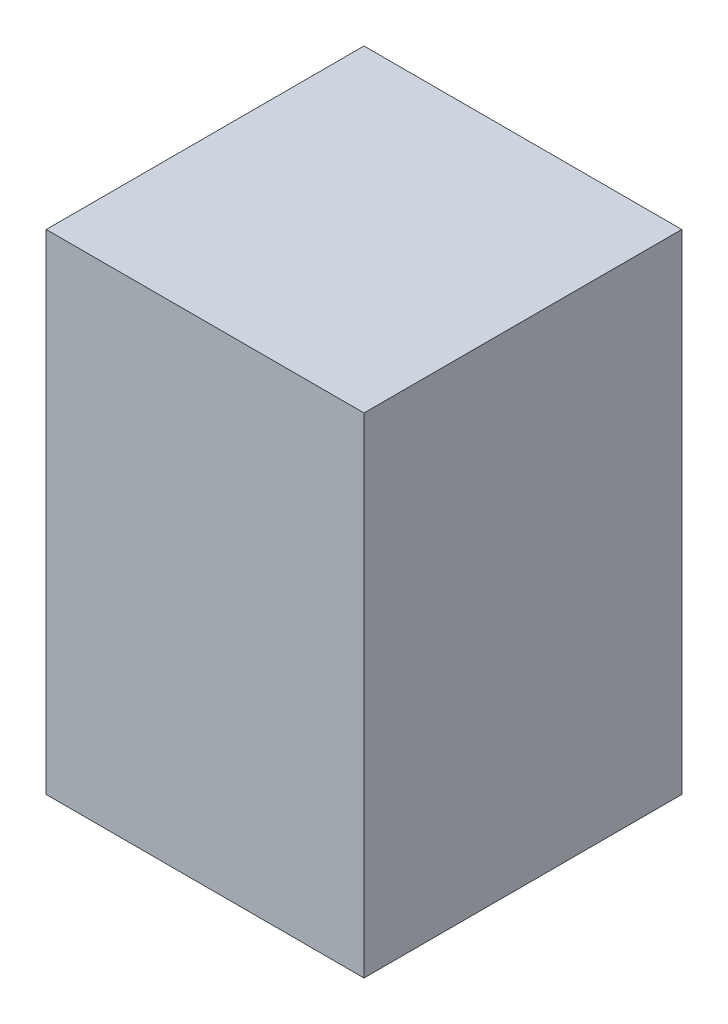
ISO-10303-21;
HEADER;
FILE_DESCRIPTION(('STEP AP214'),'2;1');
FILE_NAME('part.step','',(''),(''),'','','');
FILE_SCHEMA(('AUTOMOTIVE_DESIGN { 1 0 10303 214 1 1 1 1 }'));
ENDSEC;
DATA;
#1=APPLICATION_CONTEXT('core data for automotive mechanical design processes');
#2=APPLICATION_PROTOCOL_DEFINITION('international standard','automotive_design',2000,#1);
#3=PRODUCT_CONTEXT('',#1,'mechanical');
#4=PRODUCT('Part','Part','',(#3));
#5=PRODUCT_RELATED_PRODUCT_CATEGORY('part','',(#4));
#6=PRODUCT_DEFINITION_FORMATION('','',#4);
#7=PRODUCT_DEFINITION_CONTEXT('part definition',#1,'design');
#8=PRODUCT_DEFINITION('design','',#6,#7);
#9=PRODUCT_DEFINITION_SHAPE('','',#8);
#10=(LENGTH_UNIT() NAMED_UNIT(*) SI_UNIT(.MILLI.,.METRE.));
#11=(NAMED_UNIT(*) PLANE_ANGLE_UNIT() SI_UNIT($,.RADIAN.));
#12=(NAMED_UNIT(*) SI_UNIT($,.STERADIAN.) SOLID_ANGLE_UNIT());
#13=UNCERTAINTY_MEASURE_WITH_UNIT(LENGTH_MEASURE(1.E-05),#10,'distance_accuracy_value','');
#14=(GEOMETRIC_REPRESENTATION_CONTEXT(3) GLOBAL_UNCERTAINTY_ASSIGNED_CONTEXT((#13)) GLOBAL_UNIT_ASSIGNED_CONTEXT((#10,
#11,#12)) REPRESENTATION_CONTEXT('',''));
#15=CARTESIAN_POINT('',(0.,0.,0.));
#16=DIRECTION('',(0.,0.,1.));
#17=DIRECTION('',(1.,0.,0.));
#18=AXIS2_PLACEMENT_3D('',#15,#16,#17);
#19=CARTESIAN_POINT('',(250.,770.,250.));
#20=DIRECTION('',(-1.,0.,0.));
#21=DIRECTION('',(0.,0.,1.));
#22=AXIS2_PLACEMENT_3D('',#19,#20,#21);
#23=PLANE('',#22);
#24=DIRECTION('',(0.,0.,-1.));
#25=VECTOR('',#24,1.);
#26=CARTESIAN_POINT('',(250.,0.,250.));
#27=LINE('',#26,#25);
#28=CARTESIAN_POINT('',(250.,0.,250.));
#29=VERTEX_POINT('',#28);
#30=CARTESIAN_POINT('',(250.,0.,-250.));
#31=VERTEX_POINT('',#30);
#32=EDGE_CURVE('E99',#29,#31,#27,.T.);
#33=ORIENTED_EDGE('',*,*,#32,.T.);
#34=DIRECTION('',(0.,-1.,0.));
#35=VECTOR('',#34,1.);
#36=CARTESIAN_POINT('',(250.,770.,-250.));
#37=LINE('',#36,#35);
#38=CARTESIAN_POINT('',(250.,770.,-250.));
#39=VERTEX_POINT('',#38);
#40=EDGE_CURVE('E11',#39,#31,#37,.T.);
#41=ORIENTED_EDGE('',*,*,#40,.F.);
#42=DIRECTION('',(0.,0.,-1.));
#43=VECTOR('',#42,1.);
#44=CARTESIAN_POINT('',(250.,770.,250.));
#45=LINE('',#44,#43);
#46=CARTESIAN_POINT('',(250.,770.,250.));
#47=VERTEX_POINT('',#46);
#48=EDGE_CURVE('E87',#47,#39,#45,.T.);
#49=ORIENTED_EDGE('',*,*,#48,.F.);
#50=DIRECTION('',(0.,-1.,0.));
#51=VECTOR('',#50,1.);
#52=CARTESIAN_POINT('',(250.,770.,250.));
#53=LINE('',#52,#51);
#54=EDGE_CURVE('E95',#47,#29,#53,.T.);
#55=ORIENTED_EDGE('',*,*,#54,.T.);
#56=EDGE_LOOP('',(#33,#41,#49,#55));
#57=FACE_BOUND('',#56,.T.);
#58=ADVANCED_FACE('F36',(#57),#23,.F.);
#59=CARTESIAN_POINT('',(-250.,770.,-250.));
#60=DIRECTION('',(0.,0.,1.));
#61=DIRECTION('',(1.,0.,0.));
#62=AXIS2_PLACEMENT_3D('',#59,#60,#61);
#63=PLANE('',#62);
#64=DIRECTION('',(-1.,0.,0.));
#65=VECTOR('',#64,1.);
#66=CARTESIAN_POINT('',(-250.,0.,-250.));
#67=LINE('',#66,#65);
#68=CARTESIAN_POINT('',(-250.,0.,-250.));
#69=VERTEX_POINT('',#68);
#70=EDGE_CURVE('E91',#31,#69,#67,.T.);
#71=ORIENTED_EDGE('',*,*,#70,.T.);
#72=DIRECTION('',(0.,-1.,0.));
#73=VECTOR('',#72,1.);
#74=CARTESIAN_POINT('',(-250.,770.,-250.));
#75=LINE('',#74,#73);
#76=CARTESIAN_POINT('',(-250.,770.,-250.));
#77=VERTEX_POINT('',#76);
#78=EDGE_CURVE('E44',#77,#69,#75,.T.);
#79=ORIENTED_EDGE('',*,*,#78,.F.);
#80=DIRECTION('',(-1.,0.,0.));
#81=VECTOR('',#80,1.);
#82=CARTESIAN_POINT('',(-250.,770.,-250.));
#83=LINE('',#82,#81);
#84=EDGE_CURVE('E82',#39,#77,#83,.T.);
#85=ORIENTED_EDGE('',*,*,#84,.F.);
#86=ORIENTED_EDGE('',*,*,#40,.T.);
#87=EDGE_LOOP('',(#71,#79,#85,#86));
#88=FACE_BOUND('',#87,.T.);
#89=ADVANCED_FACE('F90',(#88),#63,.F.);
#90=CARTESIAN_POINT('',(-250.,770.,250.));
#91=DIRECTION('',(1.,0.,0.));
#92=DIRECTION('',(0.,0.,-1.));
#93=AXIS2_PLACEMENT_3D('',#90,#91,#92);
#94=PLANE('',#93);
#95=DIRECTION('',(0.,0.,1.));
#96=VECTOR('',#95,1.);
#97=CARTESIAN_POINT('',(-250.,0.,250.));
#98=LINE('',#97,#96);
#99=CARTESIAN_POINT('',(-250.,0.,250.));
#100=VERTEX_POINT('',#99);
#101=EDGE_CURVE('E69',#69,#100,#98,.T.);
#102=ORIENTED_EDGE('',*,*,#101,.T.);
#103=DIRECTION('',(0.,-1.,0.));
#104=VECTOR('',#103,1.);
#105=CARTESIAN_POINT('',(-250.,770.,250.));
#106=LINE('',#105,#104);
#107=CARTESIAN_POINT('',(-250.,770.,250.));
#108=VERTEX_POINT('',#107);
#109=EDGE_CURVE('E92',#108,#100,#106,.T.);
#110=ORIENTED_EDGE('',*,*,#109,.F.);
#111=DIRECTION('',(0.,0.,1.));
#112=VECTOR('',#111,1.);
#113=CARTESIAN_POINT('',(-250.,770.,250.));
#114=LINE('',#113,#112);
#115=EDGE_CURVE('E85',#77,#108,#114,.T.);
#116=ORIENTED_EDGE('',*,*,#115,.F.);
#117=ORIENTED_EDGE('',*,*,#78,.T.);
#118=EDGE_LOOP('',(#102,#110,#116,#117));
#119=FACE_BOUND('',#118,.T.);
#120=ADVANCED_FACE('F93',(#119),#94,.F.);
#121=CARTESIAN_POINT('',(-250.,770.,250.));
#122=DIRECTION('',(0.,0.,-1.));
#123=DIRECTION('',(-1.,0.,0.));
#124=AXIS2_PLACEMENT_3D('',#121,#122,#123);
#125=PLANE('',#124);
#126=DIRECTION('',(1.,0.,0.));
#127=VECTOR('',#126,1.);
#128=CARTESIAN_POINT('',(-250.,0.,250.));
#129=LINE('',#128,#127);
#130=EDGE_CURVE('E75',#100,#29,#129,.T.);
#131=ORIENTED_EDGE('',*,*,#130,.T.);
#132=ORIENTED_EDGE('',*,*,#54,.F.);
#133=DIRECTION('',(1.,0.,0.));
#134=VECTOR('',#133,1.);
#135=CARTESIAN_POINT('',(-250.,770.,250.));
#136=LINE('',#135,#134);
#137=EDGE_CURVE('E52',#108,#47,#136,.T.);
#138=ORIENTED_EDGE('',*,*,#137,.F.);
#139=ORIENTED_EDGE('',*,*,#109,.T.);
#140=EDGE_LOOP('',(#131,#132,#138,#139));
#141=FACE_BOUND('',#140,.T.);
#142=ADVANCED_FACE('F106',(#141),#125,.F.);
#143=CARTESIAN_POINT('',(0.,770.,0.));
#144=DIRECTION('',(0.,-1.,0.));
#145=DIRECTION('',(0.,0.,-1.));
#146=AXIS2_PLACEMENT_3D('',#143,#144,#145);
#147=PLANE('',#146);
#148=ORIENTED_EDGE('',*,*,#48,.T.);
#149=ORIENTED_EDGE('',*,*,#84,.T.);
#150=ORIENTED_EDGE('',*,*,#115,.T.);
#151=ORIENTED_EDGE('',*,*,#137,.T.);
#152=EDGE_LOOP('',(#148,#149,#150,#151));
#153=FACE_BOUND('',#152,.T.);
#154=ADVANCED_FACE('F83',(#153),#147,.F.);
#155=CARTESIAN_POINT('',(0.,0.,0.));
#156=DIRECTION('',(0.,-1.,0.));
#157=DIRECTION('',(0.,0.,-1.));
#158=AXIS2_PLACEMENT_3D('',#155,#156,#157);
#159=PLANE('',#158);
#160=ORIENTED_EDGE('',*,*,#32,.F.);
#161=ORIENTED_EDGE('',*,*,#130,.F.);
#162=ORIENTED_EDGE('',*,*,#101,.F.);
#163=ORIENTED_EDGE('',*,*,#70,.F.);
#164=EDGE_LOOP('',(#160,#161,#162,#163));
#165=FACE_BOUND('',#164,.T.);
#166=ADVANCED_FACE('F109',(#165),#159,.T.);
#167=CLOSED_SHELL('',(#58,#89,#120,#142,#154,#166));
#168=MANIFOLD_SOLID_BREP('B2',#167);
#169=ADVANCED_BREP_SHAPE_REPRESENTATION('',(#18,#168),#14);
#170=SHAPE_DEFINITION_REPRESENTATION(#9,#169);
ENDSEC;
END-ISO-10303-21;
